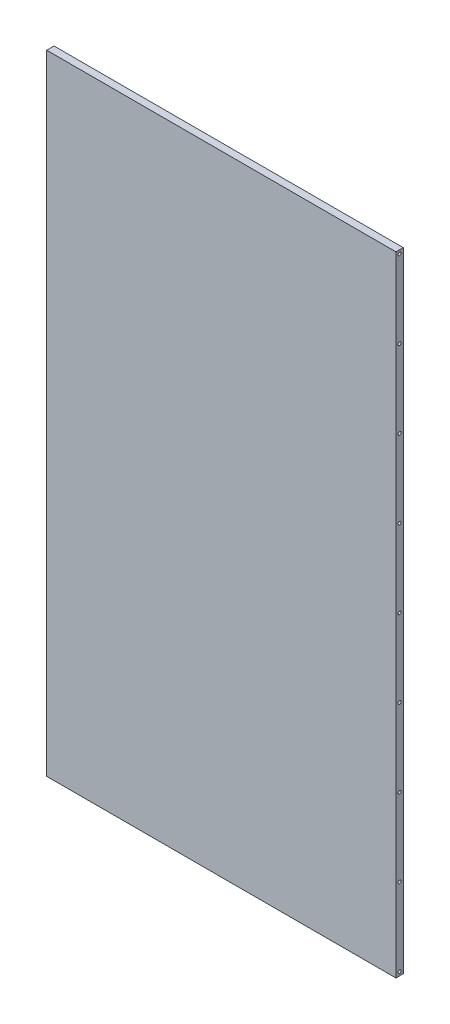
ISO-10303-21;
HEADER;
FILE_DESCRIPTION(('STEP AP214'),'2;1');
FILE_NAME('part.step','',(''),(''),'','','');
FILE_SCHEMA(('AUTOMOTIVE_DESIGN { 1 0 10303 214 1 1 1 1 }'));
ENDSEC;
DATA;
#1=APPLICATION_CONTEXT('core data for automotive mechanical design processes');
#2=APPLICATION_PROTOCOL_DEFINITION('international standard','automotive_design',2000,#1);
#3=PRODUCT_CONTEXT('',#1,'mechanical');
#4=PRODUCT('Part','Part','',(#3));
#5=PRODUCT_RELATED_PRODUCT_CATEGORY('part','',(#4));
#6=PRODUCT_DEFINITION_FORMATION('','',#4);
#7=PRODUCT_DEFINITION_CONTEXT('part definition',#1,'design');
#8=PRODUCT_DEFINITION('design','',#6,#7);
#9=PRODUCT_DEFINITION_SHAPE('','',#8);
#10=(LENGTH_UNIT() NAMED_UNIT(*) SI_UNIT(.MILLI.,.METRE.));
#11=(NAMED_UNIT(*) PLANE_ANGLE_UNIT() SI_UNIT($,.RADIAN.));
#12=(NAMED_UNIT(*) SI_UNIT($,.STERADIAN.) SOLID_ANGLE_UNIT());
#13=UNCERTAINTY_MEASURE_WITH_UNIT(LENGTH_MEASURE(1.E-05),#10,'distance_accuracy_value','');
#14=(GEOMETRIC_REPRESENTATION_CONTEXT(3) GLOBAL_UNCERTAINTY_ASSIGNED_CONTEXT((#13)) GLOBAL_UNIT_ASSIGNED_CONTEXT((#10,
#11,#12)) REPRESENTATION_CONTEXT('',''));
#15=CARTESIAN_POINT('',(0.,0.,0.));
#16=DIRECTION('',(0.,0.,1.));
#17=DIRECTION('',(1.,0.,0.));
#18=AXIS2_PLACEMENT_3D('',#15,#16,#17);
#19=CARTESIAN_POINT('',(0.,0.,5.9944));
#20=DIRECTION('',(1.,0.,0.));
#21=DIRECTION('',(0.,0.,-1.));
#22=AXIS2_PLACEMENT_3D('',#19,#20,#21);
#23=PLANE('',#22);
#24=CARTESIAN_POINT('',(0.,512.,2.9972));
#25=DIRECTION('',(-1.,0.,0.));
#26=DIRECTION('',(0.,0.,1.));
#27=AXIS2_PLACEMENT_3D('',#24,#25,#26);
#28=CIRCLE('',#27,1.24999999999997);
#29=CARTESIAN_POINT('',(0.,512.,4.24719999999997));
#30=VERTEX_POINT('',#29);
#31=EDGE_CURVE('E145',#30,#30,#28,.T.);
#32=ORIENTED_EDGE('',*,*,#31,.F.);
#33=EDGE_LOOP('',(#32));
#34=FACE_BOUND('',#33,.T.);
#35=CARTESIAN_POINT('',(0.,448.375,2.9972));
#36=DIRECTION('',(-1.,0.,0.));
#37=DIRECTION('',(0.,0.,1.));
#38=AXIS2_PLACEMENT_3D('',#35,#36,#37);
#39=CIRCLE('',#38,1.24999999999997);
#40=CARTESIAN_POINT('',(0.,448.375,4.24719999999997));
#41=VERTEX_POINT('',#40);
#42=EDGE_CURVE('E144',#41,#41,#39,.T.);
#43=ORIENTED_EDGE('',*,*,#42,.F.);
#44=EDGE_LOOP('',(#43));
#45=FACE_BOUND('',#44,.T.);
#46=CARTESIAN_POINT('',(0.,384.75,2.9972));
#47=DIRECTION('',(-1.,0.,0.));
#48=DIRECTION('',(0.,0.,1.));
#49=AXIS2_PLACEMENT_3D('',#46,#47,#48);
#50=CIRCLE('',#49,1.24999999999997);
#51=CARTESIAN_POINT('',(0.,384.75,4.24719999999997));
#52=VERTEX_POINT('',#51);
#53=EDGE_CURVE('E155',#52,#52,#50,.T.);
#54=ORIENTED_EDGE('',*,*,#53,.F.);
#55=EDGE_LOOP('',(#54));
#56=FACE_BOUND('',#55,.T.);
#57=CARTESIAN_POINT('',(0.,321.125,2.9972));
#58=DIRECTION('',(-1.,0.,0.));
#59=DIRECTION('',(0.,0.,1.));
#60=AXIS2_PLACEMENT_3D('',#57,#58,#59);
#61=CIRCLE('',#60,1.24999999999997);
#62=CARTESIAN_POINT('',(0.,321.125,4.24719999999997));
#63=VERTEX_POINT('',#62);
#64=EDGE_CURVE('E161',#63,#63,#61,.T.);
#65=ORIENTED_EDGE('',*,*,#64,.F.);
#66=EDGE_LOOP('',(#65));
#67=FACE_BOUND('',#66,.T.);
#68=CARTESIAN_POINT('',(0.,3.,2.9972));
#69=DIRECTION('',(-1.,0.,0.));
#70=DIRECTION('',(0.,0.,1.));
#71=AXIS2_PLACEMENT_3D('',#68,#69,#70);
#72=CIRCLE('',#71,1.24999999999999);
#73=CARTESIAN_POINT('',(0.,3.,4.24719999999999));
#74=VERTEX_POINT('',#73);
#75=EDGE_CURVE('E167',#74,#74,#72,.T.);
#76=ORIENTED_EDGE('',*,*,#75,.F.);
#77=EDGE_LOOP('',(#76));
#78=FACE_BOUND('',#77,.T.);
#79=CARTESIAN_POINT('',(0.,66.625,2.9972));
#80=DIRECTION('',(-1.,0.,0.));
#81=DIRECTION('',(0.,0.,1.));
#82=AXIS2_PLACEMENT_3D('',#79,#80,#81);
#83=CIRCLE('',#82,1.24999999999999);
#84=CARTESIAN_POINT('',(0.,66.625,4.24719999999999));
#85=VERTEX_POINT('',#84);
#86=EDGE_CURVE('E173',#85,#85,#83,.T.);
#87=ORIENTED_EDGE('',*,*,#86,.F.);
#88=EDGE_LOOP('',(#87));
#89=FACE_BOUND('',#88,.T.);
#90=CARTESIAN_POINT('',(0.,130.25,2.9972));
#91=DIRECTION('',(-1.,0.,0.));
#92=DIRECTION('',(0.,0.,1.));
#93=AXIS2_PLACEMENT_3D('',#90,#91,#92);
#94=CIRCLE('',#93,1.25);
#95=CARTESIAN_POINT('',(0.,130.25,4.2472));
#96=VERTEX_POINT('',#95);
#97=EDGE_CURVE('E179',#96,#96,#94,.T.);
#98=ORIENTED_EDGE('',*,*,#97,.F.);
#99=EDGE_LOOP('',(#98));
#100=FACE_BOUND('',#99,.T.);
#101=CARTESIAN_POINT('',(0.,193.875,2.9972));
#102=DIRECTION('',(-1.,0.,0.));
#103=DIRECTION('',(0.,0.,1.));
#104=AXIS2_PLACEMENT_3D('',#101,#102,#103);
#105=CIRCLE('',#104,1.25);
#106=CARTESIAN_POINT('',(0.,193.875,4.2472));
#107=VERTEX_POINT('',#106);
#108=EDGE_CURVE('E185',#107,#107,#105,.T.);
#109=ORIENTED_EDGE('',*,*,#108,.F.);
#110=EDGE_LOOP('',(#109));
#111=FACE_BOUND('',#110,.T.);
#112=CARTESIAN_POINT('',(0.,257.5,2.9972));
#113=DIRECTION('',(-1.,0.,0.));
#114=DIRECTION('',(0.,0.,1.));
#115=AXIS2_PLACEMENT_3D('',#112,#113,#114);
#116=CIRCLE('',#115,1.24999999999997);
#117=CARTESIAN_POINT('',(0.,257.5,4.24719999999997));
#118=VERTEX_POINT('',#117);
#119=EDGE_CURVE('E191',#118,#118,#116,.T.);
#120=ORIENTED_EDGE('',*,*,#119,.F.);
#121=EDGE_LOOP('',(#120));
#122=FACE_BOUND('',#121,.T.);
#123=DIRECTION('',(0.,-1.,0.));
#124=VECTOR('',#123,1.);
#125=CARTESIAN_POINT('',(0.,0.,0.));
#126=LINE('',#125,#124);
#127=CARTESIAN_POINT('',(0.,515.,0.));
#128=VERTEX_POINT('',#127);
#129=CARTESIAN_POINT('',(0.,0.,0.));
#130=VERTEX_POINT('',#129);
#131=EDGE_CURVE('E251',#128,#130,#126,.T.);
#132=ORIENTED_EDGE('',*,*,#131,.T.);
#133=DIRECTION('',(0.,0.,-1.));
#134=VECTOR('',#133,1.);
#135=CARTESIAN_POINT('',(0.,0.,5.9944));
#136=LINE('',#135,#134);
#137=CARTESIAN_POINT('',(0.,0.,5.9944));
#138=VERTEX_POINT('',#137);
#139=EDGE_CURVE('E11',#138,#130,#136,.T.);
#140=ORIENTED_EDGE('',*,*,#139,.F.);
#141=DIRECTION('',(0.,-1.,0.));
#142=VECTOR('',#141,1.);
#143=CARTESIAN_POINT('',(0.,0.,5.9944));
#144=LINE('',#143,#142);
#145=CARTESIAN_POINT('',(0.,515.,5.9944));
#146=VERTEX_POINT('',#145);
#147=EDGE_CURVE('E252',#146,#138,#144,.T.);
#148=ORIENTED_EDGE('',*,*,#147,.F.);
#149=DIRECTION('',(0.,0.,-1.));
#150=VECTOR('',#149,1.);
#151=CARTESIAN_POINT('',(0.,515.,5.9944));
#152=LINE('',#151,#150);
#153=EDGE_CURVE('E258',#146,#128,#152,.T.);
#154=ORIENTED_EDGE('',*,*,#153,.T.);
#155=EDGE_LOOP('',(#132,#140,#148,#154));
#156=FACE_BOUND('',#155,.T.);
#157=ADVANCED_FACE('F32',(#34,#45,#56,#67,#78,#89,#100,#111,#122,#156),#23,.F.);
#158=CARTESIAN_POINT('',(0.,0.,5.9944));
#159=DIRECTION('',(0.,1.,0.));
#160=DIRECTION('',(0.,0.,1.));
#161=AXIS2_PLACEMENT_3D('',#158,#159,#160);
#162=PLANE('',#161);
#163=DIRECTION('',(1.,0.,0.));
#164=VECTOR('',#163,1.);
#165=CARTESIAN_POINT('',(0.,0.,0.));
#166=LINE('',#165,#164);
#167=CARTESIAN_POINT('',(286.0056,0.,0.));
#168=VERTEX_POINT('',#167);
#169=EDGE_CURVE('E261',#130,#168,#166,.T.);
#170=ORIENTED_EDGE('',*,*,#169,.T.);
#171=DIRECTION('',(0.,0.,-1.));
#172=VECTOR('',#171,1.);
#173=CARTESIAN_POINT('',(286.0056,0.,5.9944));
#174=LINE('',#173,#172);
#175=CARTESIAN_POINT('',(286.0056,0.,5.9944));
#176=VERTEX_POINT('',#175);
#177=EDGE_CURVE('E40',#176,#168,#174,.T.);
#178=ORIENTED_EDGE('',*,*,#177,.F.);
#179=DIRECTION('',(1.,0.,0.));
#180=VECTOR('',#179,1.);
#181=CARTESIAN_POINT('',(0.,0.,5.9944));
#182=LINE('',#181,#180);
#183=EDGE_CURVE('E79',#138,#176,#182,.T.);
#184=ORIENTED_EDGE('',*,*,#183,.F.);
#185=ORIENTED_EDGE('',*,*,#139,.T.);
#186=EDGE_LOOP('',(#170,#178,#184,#185));
#187=FACE_BOUND('',#186,.T.);
#188=ADVANCED_FACE('F284',(#187),#162,.F.);
#189=CARTESIAN_POINT('',(286.0056,0.,5.9944));
#190=DIRECTION('',(-1.,0.,0.));
#191=DIRECTION('',(0.,0.,1.));
#192=AXIS2_PLACEMENT_3D('',#189,#190,#191);
#193=PLANE('',#192);
#194=CARTESIAN_POINT('',(286.0056,512.,2.9972));
#195=DIRECTION('',(1.,0.,0.));
#196=DIRECTION('',(0.,0.,-1.));
#197=AXIS2_PLACEMENT_3D('',#194,#195,#196);
#198=CIRCLE('',#197,1.24999999999997);
#199=CARTESIAN_POINT('',(286.0056,512.,1.74720000000003));
#200=VERTEX_POINT('',#199);
#201=EDGE_CURVE('E197',#200,#200,#198,.T.);
#202=ORIENTED_EDGE('',*,*,#201,.F.);
#203=EDGE_LOOP('',(#202));
#204=FACE_BOUND('',#203,.T.);
#205=CARTESIAN_POINT('',(286.0056,448.375,2.9972));
#206=DIRECTION('',(1.,0.,0.));
#207=DIRECTION('',(0.,0.,-1.));
#208=AXIS2_PLACEMENT_3D('',#205,#206,#207);
#209=CIRCLE('',#208,1.24999999999997);
#210=CARTESIAN_POINT('',(286.0056,448.375,1.74720000000003));
#211=VERTEX_POINT('',#210);
#212=EDGE_CURVE('E203',#211,#211,#209,.T.);
#213=ORIENTED_EDGE('',*,*,#212,.F.);
#214=EDGE_LOOP('',(#213));
#215=FACE_BOUND('',#214,.T.);
#216=CARTESIAN_POINT('',(286.0056,384.75,2.9972));
#217=DIRECTION('',(1.,0.,0.));
#218=DIRECTION('',(0.,0.,-1.));
#219=AXIS2_PLACEMENT_3D('',#216,#217,#218);
#220=CIRCLE('',#219,1.24999999999997);
#221=CARTESIAN_POINT('',(286.0056,384.75,1.74720000000003));
#222=VERTEX_POINT('',#221);
#223=EDGE_CURVE('E209',#222,#222,#220,.T.);
#224=ORIENTED_EDGE('',*,*,#223,.F.);
#225=EDGE_LOOP('',(#224));
#226=FACE_BOUND('',#225,.T.);
#227=CARTESIAN_POINT('',(286.0056,321.125,2.9972));
#228=DIRECTION('',(1.,0.,0.));
#229=DIRECTION('',(0.,0.,-1.));
#230=AXIS2_PLACEMENT_3D('',#227,#228,#229);
#231=CIRCLE('',#230,1.24999999999997);
#232=CARTESIAN_POINT('',(286.0056,321.125,1.74720000000003));
#233=VERTEX_POINT('',#232);
#234=EDGE_CURVE('E215',#233,#233,#231,.T.);
#235=ORIENTED_EDGE('',*,*,#234,.F.);
#236=EDGE_LOOP('',(#235));
#237=FACE_BOUND('',#236,.T.);
#238=CARTESIAN_POINT('',(286.0056,3.,2.9972));
#239=DIRECTION('',(1.,0.,0.));
#240=DIRECTION('',(0.,0.,-1.));
#241=AXIS2_PLACEMENT_3D('',#238,#239,#240);
#242=CIRCLE('',#241,1.24999999999999);
#243=CARTESIAN_POINT('',(286.0056,3.,1.74720000000001));
#244=VERTEX_POINT('',#243);
#245=EDGE_CURVE('E221',#244,#244,#242,.T.);
#246=ORIENTED_EDGE('',*,*,#245,.F.);
#247=EDGE_LOOP('',(#246));
#248=FACE_BOUND('',#247,.T.);
#249=CARTESIAN_POINT('',(286.0056,66.625,2.9972));
#250=DIRECTION('',(1.,0.,0.));
#251=DIRECTION('',(0.,0.,-1.));
#252=AXIS2_PLACEMENT_3D('',#249,#250,#251);
#253=CIRCLE('',#252,1.24999999999999);
#254=CARTESIAN_POINT('',(286.0056,66.625,1.74720000000001));
#255=VERTEX_POINT('',#254);
#256=EDGE_CURVE('E227',#255,#255,#253,.T.);
#257=ORIENTED_EDGE('',*,*,#256,.F.);
#258=EDGE_LOOP('',(#257));
#259=FACE_BOUND('',#258,.T.);
#260=CARTESIAN_POINT('',(286.0056,130.25,2.9972));
#261=DIRECTION('',(1.,0.,0.));
#262=DIRECTION('',(0.,0.,-1.));
#263=AXIS2_PLACEMENT_3D('',#260,#261,#262);
#264=CIRCLE('',#263,1.25);
#265=CARTESIAN_POINT('',(286.0056,130.25,1.7472));
#266=VERTEX_POINT('',#265);
#267=EDGE_CURVE('E233',#266,#266,#264,.T.);
#268=ORIENTED_EDGE('',*,*,#267,.F.);
#269=EDGE_LOOP('',(#268));
#270=FACE_BOUND('',#269,.T.);
#271=CARTESIAN_POINT('',(286.0056,193.875,2.9972));
#272=DIRECTION('',(1.,0.,0.));
#273=DIRECTION('',(0.,0.,-1.));
#274=AXIS2_PLACEMENT_3D('',#271,#272,#273);
#275=CIRCLE('',#274,1.25);
#276=CARTESIAN_POINT('',(286.0056,193.875,1.7472));
#277=VERTEX_POINT('',#276);
#278=EDGE_CURVE('E239',#277,#277,#275,.T.);
#279=ORIENTED_EDGE('',*,*,#278,.F.);
#280=EDGE_LOOP('',(#279));
#281=FACE_BOUND('',#280,.T.);
#282=CARTESIAN_POINT('',(286.0056,257.5,2.9972));
#283=DIRECTION('',(1.,0.,0.));
#284=DIRECTION('',(0.,0.,-1.));
#285=AXIS2_PLACEMENT_3D('',#282,#283,#284);
#286=CIRCLE('',#285,1.24999999999997);
#287=CARTESIAN_POINT('',(286.0056,257.5,1.74720000000003));
#288=VERTEX_POINT('',#287);
#289=EDGE_CURVE('E245',#288,#288,#286,.T.);
#290=ORIENTED_EDGE('',*,*,#289,.F.);
#291=EDGE_LOOP('',(#290));
#292=FACE_BOUND('',#291,.T.);
#293=DIRECTION('',(0.,1.,0.));
#294=VECTOR('',#293,1.);
#295=CARTESIAN_POINT('',(286.0056,0.,0.));
#296=LINE('',#295,#294);
#297=CARTESIAN_POINT('',(286.0056,515.,0.));
#298=VERTEX_POINT('',#297);
#299=EDGE_CURVE('E66',#168,#298,#296,.T.);
#300=ORIENTED_EDGE('',*,*,#299,.T.);
#301=DIRECTION('',(0.,0.,-1.));
#302=VECTOR('',#301,1.);
#303=CARTESIAN_POINT('',(286.0056,515.,5.9944));
#304=LINE('',#303,#302);
#305=CARTESIAN_POINT('',(286.0056,515.,5.9944));
#306=VERTEX_POINT('',#305);
#307=EDGE_CURVE('E266',#306,#298,#304,.T.);
#308=ORIENTED_EDGE('',*,*,#307,.F.);
#309=DIRECTION('',(0.,1.,0.));
#310=VECTOR('',#309,1.);
#311=CARTESIAN_POINT('',(286.0056,0.,5.9944));
#312=LINE('',#311,#310);
#313=EDGE_CURVE('E255',#176,#306,#312,.T.);
#314=ORIENTED_EDGE('',*,*,#313,.F.);
#315=ORIENTED_EDGE('',*,*,#177,.T.);
#316=EDGE_LOOP('',(#300,#308,#314,#315));
#317=FACE_BOUND('',#316,.T.);
#318=ADVANCED_FACE('F268',(#204,#215,#226,#237,#248,#259,#270,#281,#292,#317),#193,.F.);
#319=CARTESIAN_POINT('',(0.,515.,5.9944));
#320=DIRECTION('',(0.,-1.,0.));
#321=DIRECTION('',(0.,0.,-1.));
#322=AXIS2_PLACEMENT_3D('',#319,#320,#321);
#323=PLANE('',#322);
#324=DIRECTION('',(-1.,0.,0.));
#325=VECTOR('',#324,1.);
#326=CARTESIAN_POINT('',(0.,515.,0.));
#327=LINE('',#326,#325);
#328=EDGE_CURVE('E72',#298,#128,#327,.T.);
#329=ORIENTED_EDGE('',*,*,#328,.T.);
#330=ORIENTED_EDGE('',*,*,#153,.F.);
#331=DIRECTION('',(-1.,0.,0.));
#332=VECTOR('',#331,1.);
#333=CARTESIAN_POINT('',(0.,515.,5.9944));
#334=LINE('',#333,#332);
#335=EDGE_CURVE('E48',#306,#146,#334,.T.);
#336=ORIENTED_EDGE('',*,*,#335,.F.);
#337=ORIENTED_EDGE('',*,*,#307,.T.);
#338=EDGE_LOOP('',(#329,#330,#336,#337));
#339=FACE_BOUND('',#338,.T.);
#340=ADVANCED_FACE('F275',(#339),#323,.F.);
#341=CARTESIAN_POINT('',(0.,0.,5.9944));
#342=DIRECTION('',(0.,0.,-1.));
#343=DIRECTION('',(-1.,0.,0.));
#344=AXIS2_PLACEMENT_3D('',#341,#342,#343);
#345=PLANE('',#344);
#346=ORIENTED_EDGE('',*,*,#147,.T.);
#347=ORIENTED_EDGE('',*,*,#183,.T.);
#348=ORIENTED_EDGE('',*,*,#313,.T.);
#349=ORIENTED_EDGE('',*,*,#335,.T.);
#350=EDGE_LOOP('',(#346,#347,#348,#349));
#351=FACE_BOUND('',#350,.T.);
#352=ADVANCED_FACE('F277',(#351),#345,.F.);
#353=CARTESIAN_POINT('',(0.,0.,0.));
#354=DIRECTION('',(0.,0.,-1.));
#355=DIRECTION('',(-1.,0.,0.));
#356=AXIS2_PLACEMENT_3D('',#353,#354,#355);
#357=PLANE('',#356);
#358=ORIENTED_EDGE('',*,*,#131,.F.);
#359=ORIENTED_EDGE('',*,*,#328,.F.);
#360=ORIENTED_EDGE('',*,*,#299,.F.);
#361=ORIENTED_EDGE('',*,*,#169,.F.);
#362=EDGE_LOOP('',(#358,#359,#360,#361));
#363=FACE_BOUND('',#362,.T.);
#364=ADVANCED_FACE('F271',(#363),#357,.T.);
#365=CARTESIAN_POINT('',(256.0056,257.5,2.9972));
#366=DIRECTION('',(1.,0.,0.));
#367=DIRECTION('',(0.,0.,-1.));
#368=AXIS2_PLACEMENT_3D('',#365,#366,#367);
#369=CONICAL_SURFACE('',#368,1.24999999999997,1.02974425867663);
#370=CARTESIAN_POINT('',(255.254524226216,257.5,2.9972));
#371=VERTEX_POINT('',#370);
#372=VERTEX_LOOP('',#371);
#373=FACE_BOUND('',#372,.T.);
#374=CARTESIAN_POINT('',(256.0056,257.5,2.9972));
#375=DIRECTION('',(1.,0.,0.));
#376=DIRECTION('',(0.,0.,-1.));
#377=AXIS2_PLACEMENT_3D('',#374,#375,#376);
#378=CIRCLE('',#377,1.24999999999997);
#379=CARTESIAN_POINT('',(256.0056,257.5,1.74720000000003));
#380=VERTEX_POINT('',#379);
#381=EDGE_CURVE('E248',#380,#380,#378,.T.);
#382=ORIENTED_EDGE('',*,*,#381,.T.);
#383=EDGE_LOOP('',(#382));
#384=FACE_BOUND('',#383,.T.);
#385=ADVANCED_FACE('F396',(#373,#384),#369,.F.);
#386=CARTESIAN_POINT('',(286.0056,257.5,2.9972));
#387=DIRECTION('',(1.,0.,0.));
#388=DIRECTION('',(0.,0.,-1.));
#389=AXIS2_PLACEMENT_3D('',#386,#387,#388);
#390=CYLINDRICAL_SURFACE('',#389,1.24999999999997);
#391=ORIENTED_EDGE('',*,*,#381,.F.);
#392=EDGE_LOOP('',(#391));
#393=FACE_BOUND('',#392,.T.);
#394=ORIENTED_EDGE('',*,*,#289,.T.);
#395=EDGE_LOOP('',(#394));
#396=FACE_BOUND('',#395,.T.);
#397=ADVANCED_FACE('F392',(#393,#396),#390,.F.);
#398=CARTESIAN_POINT('',(256.0056,193.875,2.9972));
#399=DIRECTION('',(1.,0.,0.));
#400=DIRECTION('',(0.,0.,-1.));
#401=AXIS2_PLACEMENT_3D('',#398,#399,#400);
#402=CONICAL_SURFACE('',#401,1.25,1.02974425867664);
#403=CARTESIAN_POINT('',(255.254524226216,193.875,2.9972));
#404=VERTEX_POINT('',#403);
#405=VERTEX_LOOP('',#404);
#406=FACE_BOUND('',#405,.T.);
#407=CARTESIAN_POINT('',(256.0056,193.875,2.9972));
#408=DIRECTION('',(1.,0.,0.));
#409=DIRECTION('',(0.,0.,-1.));
#410=AXIS2_PLACEMENT_3D('',#407,#408,#409);
#411=CIRCLE('',#410,1.25);
#412=CARTESIAN_POINT('',(256.0056,193.875,1.7472));
#413=VERTEX_POINT('',#412);
#414=EDGE_CURVE('E242',#413,#413,#411,.T.);
#415=ORIENTED_EDGE('',*,*,#414,.T.);
#416=EDGE_LOOP('',(#415));
#417=FACE_BOUND('',#416,.T.);
#418=ADVANCED_FACE('F388',(#406,#417),#402,.F.);
#419=CARTESIAN_POINT('',(286.0056,193.875,2.9972));
#420=DIRECTION('',(1.,0.,0.));
#421=DIRECTION('',(0.,0.,-1.));
#422=AXIS2_PLACEMENT_3D('',#419,#420,#421);
#423=CYLINDRICAL_SURFACE('',#422,1.25);
#424=ORIENTED_EDGE('',*,*,#414,.F.);
#425=EDGE_LOOP('',(#424));
#426=FACE_BOUND('',#425,.T.);
#427=ORIENTED_EDGE('',*,*,#278,.T.);
#428=EDGE_LOOP('',(#427));
#429=FACE_BOUND('',#428,.T.);
#430=ADVANCED_FACE('F384',(#426,#429),#423,.F.);
#431=CARTESIAN_POINT('',(256.0056,130.25,2.9972));
#432=DIRECTION('',(1.,0.,0.));
#433=DIRECTION('',(0.,0.,-1.));
#434=AXIS2_PLACEMENT_3D('',#431,#432,#433);
#435=CONICAL_SURFACE('',#434,1.25,1.02974425867664);
#436=CARTESIAN_POINT('',(255.254524226216,130.25,2.9972));
#437=VERTEX_POINT('',#436);
#438=VERTEX_LOOP('',#437);
#439=FACE_BOUND('',#438,.T.);
#440=CARTESIAN_POINT('',(256.0056,130.25,2.9972));
#441=DIRECTION('',(1.,0.,0.));
#442=DIRECTION('',(0.,0.,-1.));
#443=AXIS2_PLACEMENT_3D('',#440,#441,#442);
#444=CIRCLE('',#443,1.25);
#445=CARTESIAN_POINT('',(256.0056,130.25,1.7472));
#446=VERTEX_POINT('',#445);
#447=EDGE_CURVE('E236',#446,#446,#444,.T.);
#448=ORIENTED_EDGE('',*,*,#447,.T.);
#449=EDGE_LOOP('',(#448));
#450=FACE_BOUND('',#449,.T.);
#451=ADVANCED_FACE('F380',(#439,#450),#435,.F.);
#452=CARTESIAN_POINT('',(286.0056,130.25,2.9972));
#453=DIRECTION('',(1.,0.,0.));
#454=DIRECTION('',(0.,0.,-1.));
#455=AXIS2_PLACEMENT_3D('',#452,#453,#454);
#456=CYLINDRICAL_SURFACE('',#455,1.25);
#457=ORIENTED_EDGE('',*,*,#447,.F.);
#458=EDGE_LOOP('',(#457));
#459=FACE_BOUND('',#458,.T.);
#460=ORIENTED_EDGE('',*,*,#267,.T.);
#461=EDGE_LOOP('',(#460));
#462=FACE_BOUND('',#461,.T.);
#463=ADVANCED_FACE('F376',(#459,#462),#456,.F.);
#464=CARTESIAN_POINT('',(256.0056,66.625,2.9972));
#465=DIRECTION('',(1.,0.,0.));
#466=DIRECTION('',(0.,0.,-1.));
#467=AXIS2_PLACEMENT_3D('',#464,#465,#466);
#468=CONICAL_SURFACE('',#467,1.25,1.02974425867664);
#469=CARTESIAN_POINT('',(255.254524226216,66.625,2.9972));
#470=VERTEX_POINT('',#469);
#471=VERTEX_LOOP('',#470);
#472=FACE_BOUND('',#471,.T.);
#473=CARTESIAN_POINT('',(256.0056,66.625,2.9972));
#474=DIRECTION('',(1.,0.,0.));
#475=DIRECTION('',(0.,0.,-1.));
#476=AXIS2_PLACEMENT_3D('',#473,#474,#475);
#477=CIRCLE('',#476,1.25);
#478=CARTESIAN_POINT('',(256.0056,66.625,1.7472));
#479=VERTEX_POINT('',#478);
#480=EDGE_CURVE('E230',#479,#479,#477,.T.);
#481=ORIENTED_EDGE('',*,*,#480,.T.);
#482=EDGE_LOOP('',(#481));
#483=FACE_BOUND('',#482,.T.);
#484=ADVANCED_FACE('F372',(#472,#483),#468,.F.);
#485=CARTESIAN_POINT('',(286.0056,66.625,2.9972));
#486=DIRECTION('',(1.,0.,0.));
#487=DIRECTION('',(0.,0.,-1.));
#488=AXIS2_PLACEMENT_3D('',#485,#486,#487);
#489=CYLINDRICAL_SURFACE('',#488,1.24999999999999);
#490=ORIENTED_EDGE('',*,*,#480,.F.);
#491=EDGE_LOOP('',(#490));
#492=FACE_BOUND('',#491,.T.);
#493=ORIENTED_EDGE('',*,*,#256,.T.);
#494=EDGE_LOOP('',(#493));
#495=FACE_BOUND('',#494,.T.);
#496=ADVANCED_FACE('F368',(#492,#495),#489,.F.);
#497=CARTESIAN_POINT('',(256.0056,3.,2.9972));
#498=DIRECTION('',(1.,0.,0.));
#499=DIRECTION('',(0.,0.,-1.));
#500=AXIS2_PLACEMENT_3D('',#497,#498,#499);
#501=CONICAL_SURFACE('',#500,1.25,1.02974425867664);
#502=CARTESIAN_POINT('',(255.254524226216,3.,2.9972));
#503=VERTEX_POINT('',#502);
#504=VERTEX_LOOP('',#503);
#505=FACE_BOUND('',#504,.T.);
#506=CARTESIAN_POINT('',(256.0056,3.,2.9972));
#507=DIRECTION('',(1.,0.,0.));
#508=DIRECTION('',(0.,0.,-1.));
#509=AXIS2_PLACEMENT_3D('',#506,#507,#508);
#510=CIRCLE('',#509,1.25);
#511=CARTESIAN_POINT('',(256.0056,3.,1.7472));
#512=VERTEX_POINT('',#511);
#513=EDGE_CURVE('E224',#512,#512,#510,.T.);
#514=ORIENTED_EDGE('',*,*,#513,.T.);
#515=EDGE_LOOP('',(#514));
#516=FACE_BOUND('',#515,.T.);
#517=ADVANCED_FACE('F364',(#505,#516),#501,.F.);
#518=CARTESIAN_POINT('',(286.0056,3.,2.9972));
#519=DIRECTION('',(1.,0.,0.));
#520=DIRECTION('',(0.,0.,-1.));
#521=AXIS2_PLACEMENT_3D('',#518,#519,#520);
#522=CYLINDRICAL_SURFACE('',#521,1.24999999999999);
#523=ORIENTED_EDGE('',*,*,#513,.F.);
#524=EDGE_LOOP('',(#523));
#525=FACE_BOUND('',#524,.T.);
#526=ORIENTED_EDGE('',*,*,#245,.T.);
#527=EDGE_LOOP('',(#526));
#528=FACE_BOUND('',#527,.T.);
#529=ADVANCED_FACE('F360',(#525,#528),#522,.F.);
#530=CARTESIAN_POINT('',(256.0056,321.125,2.9972));
#531=DIRECTION('',(1.,0.,0.));
#532=DIRECTION('',(0.,0.,-1.));
#533=AXIS2_PLACEMENT_3D('',#530,#531,#532);
#534=CONICAL_SURFACE('',#533,1.24999999999997,1.02974425867663);
#535=CARTESIAN_POINT('',(255.254524226216,321.125,2.9972));
#536=VERTEX_POINT('',#535);
#537=VERTEX_LOOP('',#536);
#538=FACE_BOUND('',#537,.T.);
#539=CARTESIAN_POINT('',(256.0056,321.125,2.9972));
#540=DIRECTION('',(1.,0.,0.));
#541=DIRECTION('',(0.,0.,-1.));
#542=AXIS2_PLACEMENT_3D('',#539,#540,#541);
#543=CIRCLE('',#542,1.24999999999997);
#544=CARTESIAN_POINT('',(256.0056,321.125,1.74720000000003));
#545=VERTEX_POINT('',#544);
#546=EDGE_CURVE('E218',#545,#545,#543,.T.);
#547=ORIENTED_EDGE('',*,*,#546,.T.);
#548=EDGE_LOOP('',(#547));
#549=FACE_BOUND('',#548,.T.);
#550=ADVANCED_FACE('F356',(#538,#549),#534,.F.);
#551=CARTESIAN_POINT('',(286.0056,321.125,2.9972));
#552=DIRECTION('',(1.,0.,0.));
#553=DIRECTION('',(0.,0.,-1.));
#554=AXIS2_PLACEMENT_3D('',#551,#552,#553);
#555=CYLINDRICAL_SURFACE('',#554,1.24999999999997);
#556=ORIENTED_EDGE('',*,*,#546,.F.);
#557=EDGE_LOOP('',(#556));
#558=FACE_BOUND('',#557,.T.);
#559=ORIENTED_EDGE('',*,*,#234,.T.);
#560=EDGE_LOOP('',(#559));
#561=FACE_BOUND('',#560,.T.);
#562=ADVANCED_FACE('F352',(#558,#561),#555,.F.);
#563=CARTESIAN_POINT('',(256.0056,384.75,2.9972));
#564=DIRECTION('',(1.,0.,0.));
#565=DIRECTION('',(0.,0.,-1.));
#566=AXIS2_PLACEMENT_3D('',#563,#564,#565);
#567=CONICAL_SURFACE('',#566,1.24999999999997,1.02974425867663);
#568=CARTESIAN_POINT('',(255.254524226216,384.75,2.9972));
#569=VERTEX_POINT('',#568);
#570=VERTEX_LOOP('',#569);
#571=FACE_BOUND('',#570,.T.);
#572=CARTESIAN_POINT('',(256.0056,384.75,2.9972));
#573=DIRECTION('',(1.,0.,0.));
#574=DIRECTION('',(0.,0.,-1.));
#575=AXIS2_PLACEMENT_3D('',#572,#573,#574);
#576=CIRCLE('',#575,1.24999999999997);
#577=CARTESIAN_POINT('',(256.0056,384.75,1.74720000000003));
#578=VERTEX_POINT('',#577);
#579=EDGE_CURVE('E212',#578,#578,#576,.T.);
#580=ORIENTED_EDGE('',*,*,#579,.T.);
#581=EDGE_LOOP('',(#580));
#582=FACE_BOUND('',#581,.T.);
#583=ADVANCED_FACE('F348',(#571,#582),#567,.F.);
#584=CARTESIAN_POINT('',(286.0056,384.75,2.9972));
#585=DIRECTION('',(1.,0.,0.));
#586=DIRECTION('',(0.,0.,-1.));
#587=AXIS2_PLACEMENT_3D('',#584,#585,#586);
#588=CYLINDRICAL_SURFACE('',#587,1.24999999999997);
#589=ORIENTED_EDGE('',*,*,#579,.F.);
#590=EDGE_LOOP('',(#589));
#591=FACE_BOUND('',#590,.T.);
#592=ORIENTED_EDGE('',*,*,#223,.T.);
#593=EDGE_LOOP('',(#592));
#594=FACE_BOUND('',#593,.T.);
#595=ADVANCED_FACE('F344',(#591,#594),#588,.F.);
#596=CARTESIAN_POINT('',(256.0056,448.375,2.9972));
#597=DIRECTION('',(1.,0.,0.));
#598=DIRECTION('',(0.,0.,-1.));
#599=AXIS2_PLACEMENT_3D('',#596,#597,#598);
#600=CONICAL_SURFACE('',#599,1.24999999999997,1.02974425867663);
#601=CARTESIAN_POINT('',(255.254524226216,448.375,2.9972));
#602=VERTEX_POINT('',#601);
#603=VERTEX_LOOP('',#602);
#604=FACE_BOUND('',#603,.T.);
#605=CARTESIAN_POINT('',(256.0056,448.375,2.9972));
#606=DIRECTION('',(1.,0.,0.));
#607=DIRECTION('',(0.,0.,-1.));
#608=AXIS2_PLACEMENT_3D('',#605,#606,#607);
#609=CIRCLE('',#608,1.24999999999997);
#610=CARTESIAN_POINT('',(256.0056,448.375,1.74720000000003));
#611=VERTEX_POINT('',#610);
#612=EDGE_CURVE('E206',#611,#611,#609,.T.);
#613=ORIENTED_EDGE('',*,*,#612,.T.);
#614=EDGE_LOOP('',(#613));
#615=FACE_BOUND('',#614,.T.);
#616=ADVANCED_FACE('F340',(#604,#615),#600,.F.);
#617=CARTESIAN_POINT('',(286.0056,448.375,2.9972));
#618=DIRECTION('',(1.,0.,0.));
#619=DIRECTION('',(0.,0.,-1.));
#620=AXIS2_PLACEMENT_3D('',#617,#618,#619);
#621=CYLINDRICAL_SURFACE('',#620,1.24999999999997);
#622=ORIENTED_EDGE('',*,*,#612,.F.);
#623=EDGE_LOOP('',(#622));
#624=FACE_BOUND('',#623,.T.);
#625=ORIENTED_EDGE('',*,*,#212,.T.);
#626=EDGE_LOOP('',(#625));
#627=FACE_BOUND('',#626,.T.);
#628=ADVANCED_FACE('F336',(#624,#627),#621,.F.);
#629=CARTESIAN_POINT('',(256.0056,512.,2.9972));
#630=DIRECTION('',(1.,0.,0.));
#631=DIRECTION('',(0.,0.,-1.));
#632=AXIS2_PLACEMENT_3D('',#629,#630,#631);
#633=CONICAL_SURFACE('',#632,1.24999999999997,1.02974425867663);
#634=CARTESIAN_POINT('',(255.254524226216,512.,2.9972));
#635=VERTEX_POINT('',#634);
#636=VERTEX_LOOP('',#635);
#637=FACE_BOUND('',#636,.T.);
#638=CARTESIAN_POINT('',(256.0056,512.,2.9972));
#639=DIRECTION('',(1.,0.,0.));
#640=DIRECTION('',(0.,0.,-1.));
#641=AXIS2_PLACEMENT_3D('',#638,#639,#640);
#642=CIRCLE('',#641,1.24999999999997);
#643=CARTESIAN_POINT('',(256.0056,512.,1.74720000000003));
#644=VERTEX_POINT('',#643);
#645=EDGE_CURVE('E200',#644,#644,#642,.T.);
#646=ORIENTED_EDGE('',*,*,#645,.T.);
#647=EDGE_LOOP('',(#646));
#648=FACE_BOUND('',#647,.T.);
#649=ADVANCED_FACE('F332',(#637,#648),#633,.F.);
#650=CARTESIAN_POINT('',(286.0056,512.,2.9972));
#651=DIRECTION('',(1.,0.,0.));
#652=DIRECTION('',(0.,0.,-1.));
#653=AXIS2_PLACEMENT_3D('',#650,#651,#652);
#654=CYLINDRICAL_SURFACE('',#653,1.24999999999997);
#655=ORIENTED_EDGE('',*,*,#645,.F.);
#656=EDGE_LOOP('',(#655));
#657=FACE_BOUND('',#656,.T.);
#658=ORIENTED_EDGE('',*,*,#201,.T.);
#659=EDGE_LOOP('',(#658));
#660=FACE_BOUND('',#659,.T.);
#661=ADVANCED_FACE('F324',(#657,#660),#654,.F.);
#662=CARTESIAN_POINT('',(30.,257.5,2.9972));
#663=DIRECTION('',(-1.,0.,0.));
#664=DIRECTION('',(0.,0.,1.));
#665=AXIS2_PLACEMENT_3D('',#662,#663,#664);
#666=CONICAL_SURFACE('',#665,1.24999999999997,1.02974425867664);
#667=CARTESIAN_POINT('',(30.7510757737845,257.5,2.9972));
#668=VERTEX_POINT('',#667);
#669=VERTEX_LOOP('',#668);
#670=FACE_BOUND('',#669,.T.);
#671=CARTESIAN_POINT('',(30.,257.5,2.9972));
#672=DIRECTION('',(-1.,0.,0.));
#673=DIRECTION('',(0.,0.,1.));
#674=AXIS2_PLACEMENT_3D('',#671,#672,#673);
#675=CIRCLE('',#674,1.24999999999997);
#676=CARTESIAN_POINT('',(30.,257.5,4.24719999999997));
#677=VERTEX_POINT('',#676);
#678=EDGE_CURVE('E194',#677,#677,#675,.T.);
#679=ORIENTED_EDGE('',*,*,#678,.T.);
#680=EDGE_LOOP('',(#679));
#681=FACE_BOUND('',#680,.T.);
#682=ADVANCED_FACE('F314',(#670,#681),#666,.F.);
#683=CARTESIAN_POINT('',(0.,257.5,2.9972));
#684=DIRECTION('',(-1.,0.,0.));
#685=DIRECTION('',(0.,0.,1.));
#686=AXIS2_PLACEMENT_3D('',#683,#684,#685);
#687=CYLINDRICAL_SURFACE('',#686,1.24999999999997);
#688=ORIENTED_EDGE('',*,*,#678,.F.);
#689=EDGE_LOOP('',(#688));
#690=FACE_BOUND('',#689,.T.);
#691=ORIENTED_EDGE('',*,*,#119,.T.);
#692=EDGE_LOOP('',(#691));
#693=FACE_BOUND('',#692,.T.);
#694=ADVANCED_FACE('F311',(#690,#693),#687,.F.);
#695=CARTESIAN_POINT('',(30.,193.875,2.9972));
#696=DIRECTION('',(-1.,0.,0.));
#697=DIRECTION('',(0.,0.,1.));
#698=AXIS2_PLACEMENT_3D('',#695,#696,#697);
#699=CONICAL_SURFACE('',#698,1.25,1.02974425867665);
#700=CARTESIAN_POINT('',(30.7510757737845,193.875,2.9972));
#701=VERTEX_POINT('',#700);
#702=VERTEX_LOOP('',#701);
#703=FACE_BOUND('',#702,.T.);
#704=CARTESIAN_POINT('',(30.,193.875,2.9972));
#705=DIRECTION('',(-1.,0.,0.));
#706=DIRECTION('',(0.,0.,1.));
#707=AXIS2_PLACEMENT_3D('',#704,#705,#706);
#708=CIRCLE('',#707,1.25);
#709=CARTESIAN_POINT('',(30.,193.875,4.2472));
#710=VERTEX_POINT('',#709);
#711=EDGE_CURVE('E188',#710,#710,#708,.T.);
#712=ORIENTED_EDGE('',*,*,#711,.T.);
#713=EDGE_LOOP('',(#712));
#714=FACE_BOUND('',#713,.T.);
#715=ADVANCED_FACE('F313',(#703,#714),#699,.F.);
#716=CARTESIAN_POINT('',(0.,193.875,2.9972));
#717=DIRECTION('',(-1.,0.,0.));
#718=DIRECTION('',(0.,0.,1.));
#719=AXIS2_PLACEMENT_3D('',#716,#717,#718);
#720=CYLINDRICAL_SURFACE('',#719,1.25);
#721=ORIENTED_EDGE('',*,*,#711,.F.);
#722=EDGE_LOOP('',(#721));
#723=FACE_BOUND('',#722,.T.);
#724=ORIENTED_EDGE('',*,*,#108,.T.);
#725=EDGE_LOOP('',(#724));
#726=FACE_BOUND('',#725,.T.);
#727=ADVANCED_FACE('F321',(#723,#726),#720,.F.);
#728=CARTESIAN_POINT('',(30.,130.25,2.9972));
#729=DIRECTION('',(-1.,0.,0.));
#730=DIRECTION('',(0.,0.,1.));
#731=AXIS2_PLACEMENT_3D('',#728,#729,#730);
#732=CONICAL_SURFACE('',#731,1.25,1.02974425867665);
#733=CARTESIAN_POINT('',(30.7510757737845,130.25,2.9972));
#734=VERTEX_POINT('',#733);
#735=VERTEX_LOOP('',#734);
#736=FACE_BOUND('',#735,.T.);
#737=CARTESIAN_POINT('',(30.,130.25,2.9972));
#738=DIRECTION('',(-1.,0.,0.));
#739=DIRECTION('',(0.,0.,1.));
#740=AXIS2_PLACEMENT_3D('',#737,#738,#739);
#741=CIRCLE('',#740,1.25);
#742=CARTESIAN_POINT('',(30.,130.25,4.2472));
#743=VERTEX_POINT('',#742);
#744=EDGE_CURVE('E182',#743,#743,#741,.T.);
#745=ORIENTED_EDGE('',*,*,#744,.T.);
#746=EDGE_LOOP('',(#745));
#747=FACE_BOUND('',#746,.T.);
#748=ADVANCED_FACE('F503',(#736,#747),#732,.F.);
#749=CARTESIAN_POINT('',(0.,130.25,2.9972));
#750=DIRECTION('',(-1.,0.,0.));
#751=DIRECTION('',(0.,0.,1.));
#752=AXIS2_PLACEMENT_3D('',#749,#750,#751);
#753=CYLINDRICAL_SURFACE('',#752,1.25);
#754=ORIENTED_EDGE('',*,*,#744,.F.);
#755=EDGE_LOOP('',(#754));
#756=FACE_BOUND('',#755,.T.);
#757=ORIENTED_EDGE('',*,*,#97,.T.);
#758=EDGE_LOOP('',(#757));
#759=FACE_BOUND('',#758,.T.);
#760=ADVANCED_FACE('F512',(#756,#759),#753,.F.);
#761=CARTESIAN_POINT('',(30.,66.625,2.9972));
#762=DIRECTION('',(-1.,0.,0.));
#763=DIRECTION('',(0.,0.,1.));
#764=AXIS2_PLACEMENT_3D('',#761,#762,#763);
#765=CONICAL_SURFACE('',#764,1.25,1.02974425867665);
#766=CARTESIAN_POINT('',(30.7510757737845,66.625,2.9972));
#767=VERTEX_POINT('',#766);
#768=VERTEX_LOOP('',#767);
#769=FACE_BOUND('',#768,.T.);
#770=CARTESIAN_POINT('',(30.,66.625,2.9972));
#771=DIRECTION('',(-1.,0.,0.));
#772=DIRECTION('',(0.,0.,1.));
#773=AXIS2_PLACEMENT_3D('',#770,#771,#772);
#774=CIRCLE('',#773,1.25);
#775=CARTESIAN_POINT('',(30.,66.625,4.2472));
#776=VERTEX_POINT('',#775);
#777=EDGE_CURVE('E176',#776,#776,#774,.T.);
#778=ORIENTED_EDGE('',*,*,#777,.T.);
#779=EDGE_LOOP('',(#778));
#780=FACE_BOUND('',#779,.T.);
#781=ADVANCED_FACE('F522',(#769,#780),#765,.F.);
#782=CARTESIAN_POINT('',(0.,66.625,2.9972));
#783=DIRECTION('',(-1.,0.,0.));
#784=DIRECTION('',(0.,0.,1.));
#785=AXIS2_PLACEMENT_3D('',#782,#783,#784);
#786=CYLINDRICAL_SURFACE('',#785,1.24999999999999);
#787=ORIENTED_EDGE('',*,*,#777,.F.);
#788=EDGE_LOOP('',(#787));
#789=FACE_BOUND('',#788,.T.);
#790=ORIENTED_EDGE('',*,*,#86,.T.);
#791=EDGE_LOOP('',(#790));
#792=FACE_BOUND('',#791,.T.);
#793=ADVANCED_FACE('F532',(#789,#792),#786,.F.);
#794=CARTESIAN_POINT('',(30.,3.,2.9972));
#795=DIRECTION('',(-1.,0.,0.));
#796=DIRECTION('',(0.,0.,1.));
#797=AXIS2_PLACEMENT_3D('',#794,#795,#796);
#798=CONICAL_SURFACE('',#797,1.25,1.02974425867665);
#799=CARTESIAN_POINT('',(30.7510757737845,3.,2.9972));
#800=VERTEX_POINT('',#799);
#801=VERTEX_LOOP('',#800);
#802=FACE_BOUND('',#801,.T.);
#803=CARTESIAN_POINT('',(30.,3.,2.9972));
#804=DIRECTION('',(-1.,0.,0.));
#805=DIRECTION('',(0.,0.,1.));
#806=AXIS2_PLACEMENT_3D('',#803,#804,#805);
#807=CIRCLE('',#806,1.25);
#808=CARTESIAN_POINT('',(30.,3.,4.2472));
#809=VERTEX_POINT('',#808);
#810=EDGE_CURVE('E170',#809,#809,#807,.T.);
#811=ORIENTED_EDGE('',*,*,#810,.T.);
#812=EDGE_LOOP('',(#811));
#813=FACE_BOUND('',#812,.T.);
#814=ADVANCED_FACE('F542',(#802,#813),#798,.F.);
#815=CARTESIAN_POINT('',(0.,3.,2.9972));
#816=DIRECTION('',(-1.,0.,0.));
#817=DIRECTION('',(0.,0.,1.));
#818=AXIS2_PLACEMENT_3D('',#815,#816,#817);
#819=CYLINDRICAL_SURFACE('',#818,1.24999999999999);
#820=ORIENTED_EDGE('',*,*,#810,.F.);
#821=EDGE_LOOP('',(#820));
#822=FACE_BOUND('',#821,.T.);
#823=ORIENTED_EDGE('',*,*,#75,.T.);
#824=EDGE_LOOP('',(#823));
#825=FACE_BOUND('',#824,.T.);
#826=ADVANCED_FACE('F552',(#822,#825),#819,.F.);
#827=CARTESIAN_POINT('',(30.,321.125,2.9972));
#828=DIRECTION('',(-1.,0.,0.));
#829=DIRECTION('',(0.,0.,1.));
#830=AXIS2_PLACEMENT_3D('',#827,#828,#829);
#831=CONICAL_SURFACE('',#830,1.24999999999997,1.02974425867664);
#832=CARTESIAN_POINT('',(30.7510757737845,321.125,2.9972));
#833=VERTEX_POINT('',#832);
#834=VERTEX_LOOP('',#833);
#835=FACE_BOUND('',#834,.T.);
#836=CARTESIAN_POINT('',(30.,321.125,2.9972));
#837=DIRECTION('',(-1.,0.,0.));
#838=DIRECTION('',(0.,0.,1.));
#839=AXIS2_PLACEMENT_3D('',#836,#837,#838);
#840=CIRCLE('',#839,1.24999999999997);
#841=CARTESIAN_POINT('',(30.,321.125,4.24719999999997));
#842=VERTEX_POINT('',#841);
#843=EDGE_CURVE('E164',#842,#842,#840,.T.);
#844=ORIENTED_EDGE('',*,*,#843,.T.);
#845=EDGE_LOOP('',(#844));
#846=FACE_BOUND('',#845,.T.);
#847=ADVANCED_FACE('F562',(#835,#846),#831,.F.);
#848=CARTESIAN_POINT('',(0.,321.125,2.9972));
#849=DIRECTION('',(-1.,0.,0.));
#850=DIRECTION('',(0.,0.,1.));
#851=AXIS2_PLACEMENT_3D('',#848,#849,#850);
#852=CYLINDRICAL_SURFACE('',#851,1.24999999999997);
#853=ORIENTED_EDGE('',*,*,#843,.F.);
#854=EDGE_LOOP('',(#853));
#855=FACE_BOUND('',#854,.T.);
#856=ORIENTED_EDGE('',*,*,#64,.T.);
#857=EDGE_LOOP('',(#856));
#858=FACE_BOUND('',#857,.T.);
#859=ADVANCED_FACE('F572',(#855,#858),#852,.F.);
#860=CARTESIAN_POINT('',(30.,384.75,2.9972));
#861=DIRECTION('',(-1.,0.,0.));
#862=DIRECTION('',(0.,0.,1.));
#863=AXIS2_PLACEMENT_3D('',#860,#861,#862);
#864=CONICAL_SURFACE('',#863,1.24999999999997,1.02974425867664);
#865=CARTESIAN_POINT('',(30.7510757737845,384.75,2.9972));
#866=VERTEX_POINT('',#865);
#867=VERTEX_LOOP('',#866);
#868=FACE_BOUND('',#867,.T.);
#869=CARTESIAN_POINT('',(30.,384.75,2.9972));
#870=DIRECTION('',(-1.,0.,0.));
#871=DIRECTION('',(0.,0.,1.));
#872=AXIS2_PLACEMENT_3D('',#869,#870,#871);
#873=CIRCLE('',#872,1.24999999999997);
#874=CARTESIAN_POINT('',(30.,384.75,4.24719999999997));
#875=VERTEX_POINT('',#874);
#876=EDGE_CURVE('E158',#875,#875,#873,.T.);
#877=ORIENTED_EDGE('',*,*,#876,.T.);
#878=EDGE_LOOP('',(#877));
#879=FACE_BOUND('',#878,.T.);
#880=ADVANCED_FACE('F582',(#868,#879),#864,.F.);
#881=CARTESIAN_POINT('',(0.,384.75,2.9972));
#882=DIRECTION('',(-1.,0.,0.));
#883=DIRECTION('',(0.,0.,1.));
#884=AXIS2_PLACEMENT_3D('',#881,#882,#883);
#885=CYLINDRICAL_SURFACE('',#884,1.24999999999997);
#886=ORIENTED_EDGE('',*,*,#876,.F.);
#887=EDGE_LOOP('',(#886));
#888=FACE_BOUND('',#887,.T.);
#889=ORIENTED_EDGE('',*,*,#53,.T.);
#890=EDGE_LOOP('',(#889));
#891=FACE_BOUND('',#890,.T.);
#892=ADVANCED_FACE('F592',(#888,#891),#885,.F.);
#893=CARTESIAN_POINT('',(30.,448.375,2.9972));
#894=DIRECTION('',(-1.,0.,0.));
#895=DIRECTION('',(0.,0.,1.));
#896=AXIS2_PLACEMENT_3D('',#893,#894,#895);
#897=CONICAL_SURFACE('',#896,1.24999999999997,1.02974425867664);
#898=CARTESIAN_POINT('',(30.7510757737845,448.375,2.9972));
#899=VERTEX_POINT('',#898);
#900=VERTEX_LOOP('',#899);
#901=FACE_BOUND('',#900,.T.);
#902=CARTESIAN_POINT('',(30.,448.375,2.9972));
#903=DIRECTION('',(-1.,0.,0.));
#904=DIRECTION('',(0.,0.,1.));
#905=AXIS2_PLACEMENT_3D('',#902,#903,#904);
#906=CIRCLE('',#905,1.24999999999997);
#907=CARTESIAN_POINT('',(30.,448.375,4.24719999999997));
#908=VERTEX_POINT('',#907);
#909=EDGE_CURVE('E148',#908,#908,#906,.T.);
#910=ORIENTED_EDGE('',*,*,#909,.T.);
#911=EDGE_LOOP('',(#910));
#912=FACE_BOUND('',#911,.T.);
#913=ADVANCED_FACE('F602',(#901,#912),#897,.F.);
#914=CARTESIAN_POINT('',(0.,448.375,2.9972));
#915=DIRECTION('',(-1.,0.,0.));
#916=DIRECTION('',(0.,0.,1.));
#917=AXIS2_PLACEMENT_3D('',#914,#915,#916);
#918=CYLINDRICAL_SURFACE('',#917,1.24999999999997);
#919=ORIENTED_EDGE('',*,*,#909,.F.);
#920=EDGE_LOOP('',(#919));
#921=FACE_BOUND('',#920,.T.);
#922=ORIENTED_EDGE('',*,*,#42,.T.);
#923=EDGE_LOOP('',(#922));
#924=FACE_BOUND('',#923,.T.);
#925=ADVANCED_FACE('F138',(#921,#924),#918,.F.);
#926=CARTESIAN_POINT('',(30.,512.,2.9972));
#927=DIRECTION('',(-1.,0.,0.));
#928=DIRECTION('',(0.,0.,1.));
#929=AXIS2_PLACEMENT_3D('',#926,#927,#928);
#930=CONICAL_SURFACE('',#929,1.24999999999997,1.02974425867664);
#931=CARTESIAN_POINT('',(30.7510757737845,512.,2.9972));
#932=VERTEX_POINT('',#931);
#933=VERTEX_LOOP('',#932);
#934=FACE_BOUND('',#933,.T.);
#935=CARTESIAN_POINT('',(30.,512.,2.9972));
#936=DIRECTION('',(-1.,0.,0.));
#937=DIRECTION('',(0.,0.,1.));
#938=AXIS2_PLACEMENT_3D('',#935,#936,#937);
#939=CIRCLE('',#938,1.24999999999997);
#940=CARTESIAN_POINT('',(30.,512.,4.24719999999997));
#941=VERTEX_POINT('',#940);
#942=EDGE_CURVE('E142',#941,#941,#939,.T.);
#943=ORIENTED_EDGE('',*,*,#942,.T.);
#944=EDGE_LOOP('',(#943));
#945=FACE_BOUND('',#944,.T.);
#946=ADVANCED_FACE('F134',(#934,#945),#930,.F.);
#947=CARTESIAN_POINT('',(0.,512.,2.9972));
#948=DIRECTION('',(-1.,0.,0.));
#949=DIRECTION('',(0.,0.,1.));
#950=AXIS2_PLACEMENT_3D('',#947,#948,#949);
#951=CYLINDRICAL_SURFACE('',#950,1.24999999999997);
#952=ORIENTED_EDGE('',*,*,#942,.F.);
#953=EDGE_LOOP('',(#952));
#954=FACE_BOUND('',#953,.T.);
#955=ORIENTED_EDGE('',*,*,#31,.T.);
#956=EDGE_LOOP('',(#955));
#957=FACE_BOUND('',#956,.T.);
#958=ADVANCED_FACE('F137',(#954,#957),#951,.F.);
#959=CLOSED_SHELL('',(#157,#188,#318,#340,#352,#364,#385,#397,#418,#430,#451,#463,#484,#496,
#517,#529,#550,#562,#583,#595,#616,#628,#649,#661,#682,#694,#715,#727,#748,#760,#781,#793,#814,
#826,#847,#859,#880,#892,#913,#925,#946,#958));
#960=MANIFOLD_SOLID_BREP('B2',#959);
#961=ADVANCED_BREP_SHAPE_REPRESENTATION('',(#18,#960),#14);
#962=SHAPE_DEFINITION_REPRESENTATION(#9,#961);
ENDSEC;
END-ISO-10303-21;
